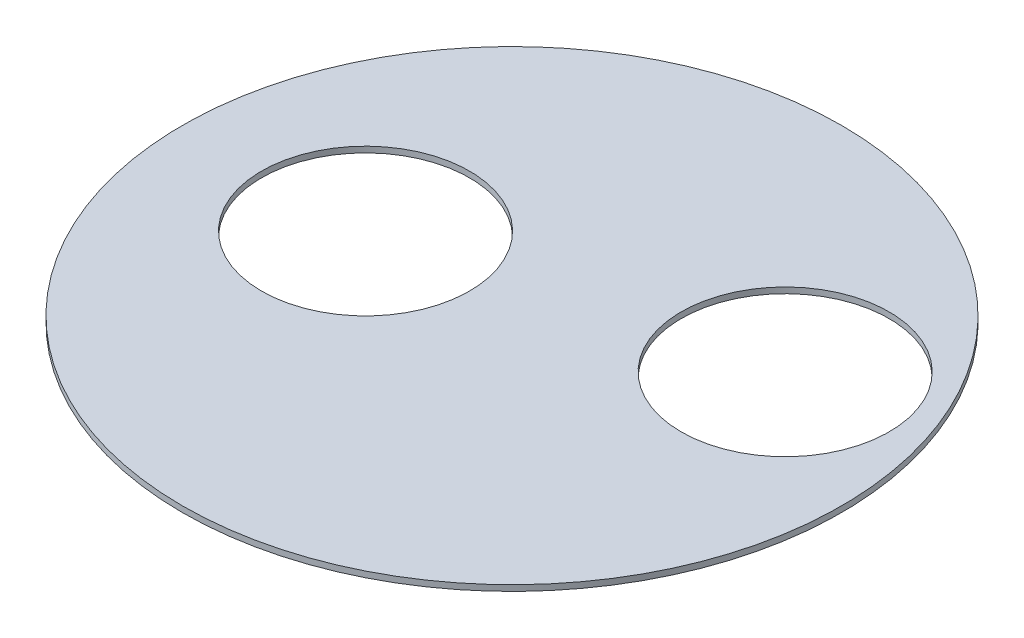
ISO-10303-21;
HEADER;
FILE_DESCRIPTION(('STEP AP214'),'2;1');
FILE_NAME('part.step','',(''),(''),'','','');
FILE_SCHEMA(('AUTOMOTIVE_DESIGN { 1 0 10303 214 1 1 1 1 }'));
ENDSEC;
DATA;
#1=APPLICATION_CONTEXT('core data for automotive mechanical design processes');
#2=APPLICATION_PROTOCOL_DEFINITION('international standard','automotive_design',2000,#1);
#3=PRODUCT_CONTEXT('',#1,'mechanical');
#4=PRODUCT('Part','Part','',(#3));
#5=PRODUCT_RELATED_PRODUCT_CATEGORY('part','',(#4));
#6=PRODUCT_DEFINITION_FORMATION('','',#4);
#7=PRODUCT_DEFINITION_CONTEXT('part definition',#1,'design');
#8=PRODUCT_DEFINITION('design','',#6,#7);
#9=PRODUCT_DEFINITION_SHAPE('','',#8);
#10=(LENGTH_UNIT() NAMED_UNIT(*) SI_UNIT(.MILLI.,.METRE.));
#11=(NAMED_UNIT(*) PLANE_ANGLE_UNIT() SI_UNIT($,.RADIAN.));
#12=(NAMED_UNIT(*) SI_UNIT($,.STERADIAN.) SOLID_ANGLE_UNIT());
#13=UNCERTAINTY_MEASURE_WITH_UNIT(LENGTH_MEASURE(1.E-05),#10,'distance_accuracy_value','');
#14=(GEOMETRIC_REPRESENTATION_CONTEXT(3) GLOBAL_UNCERTAINTY_ASSIGNED_CONTEXT((#13)) GLOBAL_UNIT_ASSIGNED_CONTEXT((#10,
#11,#12)) REPRESENTATION_CONTEXT('',''));
#15=CARTESIAN_POINT('',(0.,0.,0.));
#16=DIRECTION('',(0.,0.,1.));
#17=DIRECTION('',(1.,0.,0.));
#18=AXIS2_PLACEMENT_3D('',#15,#16,#17);
#19=CARTESIAN_POINT('',(0.,2.,0.));
#20=DIRECTION('',(0.,1.,0.));
#21=DIRECTION('',(0.,0.,1.));
#22=AXIS2_PLACEMENT_3D('',#19,#20,#21);
#23=PLANE('',#22);
#24=CARTESIAN_POINT('',(-50.,2.,0.));
#25=DIRECTION('',(0.,1.,0.));
#26=DIRECTION('',(0.,0.,1.));
#27=AXIS2_PLACEMENT_3D('',#24,#25,#26);
#28=CIRCLE('',#27,35.5);
#29=CARTESIAN_POINT('',(-50.,2.,35.5));
#30=VERTEX_POINT('',#29);
#31=EDGE_CURVE('E41',#30,#30,#28,.T.);
#32=ORIENTED_EDGE('',*,*,#31,.F.);
#33=EDGE_LOOP('',(#32));
#34=FACE_BOUND('',#33,.T.);
#35=CARTESIAN_POINT('',(0.,2.,0.));
#36=DIRECTION('',(0.,1.,0.));
#37=DIRECTION('',(0.,0.,1.));
#38=AXIS2_PLACEMENT_3D('',#35,#36,#37);
#39=CIRCLE('',#38,112.5);
#40=CARTESIAN_POINT('',(0.,2.,112.5));
#41=VERTEX_POINT('',#40);
#42=EDGE_CURVE('E10',#41,#41,#39,.T.);
#43=ORIENTED_EDGE('',*,*,#42,.T.);
#44=EDGE_LOOP('',(#43));
#45=FACE_BOUND('',#44,.T.);
#46=CARTESIAN_POINT('',(63.2455532033675,2.,-30.));
#47=DIRECTION('',(0.,1.,0.));
#48=DIRECTION('',(0.,0.,1.));
#49=AXIS2_PLACEMENT_3D('',#46,#47,#48);
#50=CIRCLE('',#49,35.5);
#51=CARTESIAN_POINT('',(63.2455532033675,2.,5.50000000000005));
#52=VERTEX_POINT('',#51);
#53=EDGE_CURVE('E46',#52,#52,#50,.T.);
#54=ORIENTED_EDGE('',*,*,#53,.F.);
#55=EDGE_LOOP('',(#54));
#56=FACE_BOUND('',#55,.T.);
#57=ADVANCED_FACE('F30',(#34,#45,#56),#23,.T.);
#58=CARTESIAN_POINT('',(0.,0.,0.));
#59=DIRECTION('',(0.,1.,0.));
#60=DIRECTION('',(0.,0.,1.));
#61=AXIS2_PLACEMENT_3D('',#58,#59,#60);
#62=PLANE('',#61);
#63=CARTESIAN_POINT('',(0.,0.,0.));
#64=DIRECTION('',(0.,1.,0.));
#65=DIRECTION('',(0.,0.,1.));
#66=AXIS2_PLACEMENT_3D('',#63,#64,#65);
#67=CIRCLE('',#66,112.5);
#68=CARTESIAN_POINT('',(0.,0.,112.5));
#69=VERTEX_POINT('',#68);
#70=EDGE_CURVE('E34',#69,#69,#67,.T.);
#71=ORIENTED_EDGE('',*,*,#70,.F.);
#72=EDGE_LOOP('',(#71));
#73=FACE_BOUND('',#72,.T.);
#74=CARTESIAN_POINT('',(-50.,0.,0.));
#75=DIRECTION('',(0.,1.,0.));
#76=DIRECTION('',(0.,0.,1.));
#77=AXIS2_PLACEMENT_3D('',#74,#75,#76);
#78=CIRCLE('',#77,35.5);
#79=CARTESIAN_POINT('',(-50.,0.,35.5));
#80=VERTEX_POINT('',#79);
#81=EDGE_CURVE('E43',#80,#80,#78,.T.);
#82=ORIENTED_EDGE('',*,*,#81,.T.);
#83=EDGE_LOOP('',(#82));
#84=FACE_BOUND('',#83,.T.);
#85=CARTESIAN_POINT('',(63.2455532033675,0.,-30.));
#86=DIRECTION('',(0.,1.,0.));
#87=DIRECTION('',(0.,0.,1.));
#88=AXIS2_PLACEMENT_3D('',#85,#86,#87);
#89=CIRCLE('',#88,35.5);
#90=CARTESIAN_POINT('',(63.2455532033675,0.,5.50000000000005));
#91=VERTEX_POINT('',#90);
#92=EDGE_CURVE('E49',#91,#91,#89,.T.);
#93=ORIENTED_EDGE('',*,*,#92,.T.);
#94=EDGE_LOOP('',(#93));
#95=FACE_BOUND('',#94,.T.);
#96=ADVANCED_FACE('F59',(#73,#84,#95),#62,.F.);
#97=CARTESIAN_POINT('',(0.,2.,0.));
#98=DIRECTION('',(0.,-1.,0.));
#99=DIRECTION('',(0.,0.,-1.));
#100=AXIS2_PLACEMENT_3D('',#97,#98,#99);
#101=CYLINDRICAL_SURFACE('',#100,112.5);
#102=ORIENTED_EDGE('',*,*,#42,.F.);
#103=EDGE_LOOP('',(#102));
#104=FACE_BOUND('',#103,.T.);
#105=ORIENTED_EDGE('',*,*,#70,.T.);
#106=EDGE_LOOP('',(#105));
#107=FACE_BOUND('',#106,.T.);
#108=ADVANCED_FACE('F32',(#104,#107),#101,.T.);
#109=CARTESIAN_POINT('',(-50.,2.,0.));
#110=DIRECTION('',(0.,-1.,0.));
#111=DIRECTION('',(0.,0.,-1.));
#112=AXIS2_PLACEMENT_3D('',#109,#110,#111);
#113=CYLINDRICAL_SURFACE('',#112,35.5);
#114=ORIENTED_EDGE('',*,*,#31,.T.);
#115=EDGE_LOOP('',(#114));
#116=FACE_BOUND('',#115,.T.);
#117=ORIENTED_EDGE('',*,*,#81,.F.);
#118=EDGE_LOOP('',(#117));
#119=FACE_BOUND('',#118,.T.);
#120=ADVANCED_FACE('F68',(#116,#119),#113,.F.);
#121=CARTESIAN_POINT('',(63.2455532033675,2.,-30.));
#122=DIRECTION('',(0.,-1.,0.));
#123=DIRECTION('',(0.,0.,-1.));
#124=AXIS2_PLACEMENT_3D('',#121,#122,#123);
#125=CYLINDRICAL_SURFACE('',#124,35.5);
#126=ORIENTED_EDGE('',*,*,#53,.T.);
#127=EDGE_LOOP('',(#126));
#128=FACE_BOUND('',#127,.T.);
#129=ORIENTED_EDGE('',*,*,#92,.F.);
#130=EDGE_LOOP('',(#129));
#131=FACE_BOUND('',#130,.T.);
#132=ADVANCED_FACE('F55',(#128,#131),#125,.F.);
#133=CLOSED_SHELL('',(#57,#96,#108,#120,#132));
#134=MANIFOLD_SOLID_BREP('B2',#133);
#135=ADVANCED_BREP_SHAPE_REPRESENTATION('',(#18,#134),#14);
#136=SHAPE_DEFINITION_REPRESENTATION(#9,#135);
ENDSEC;
END-ISO-10303-21;
